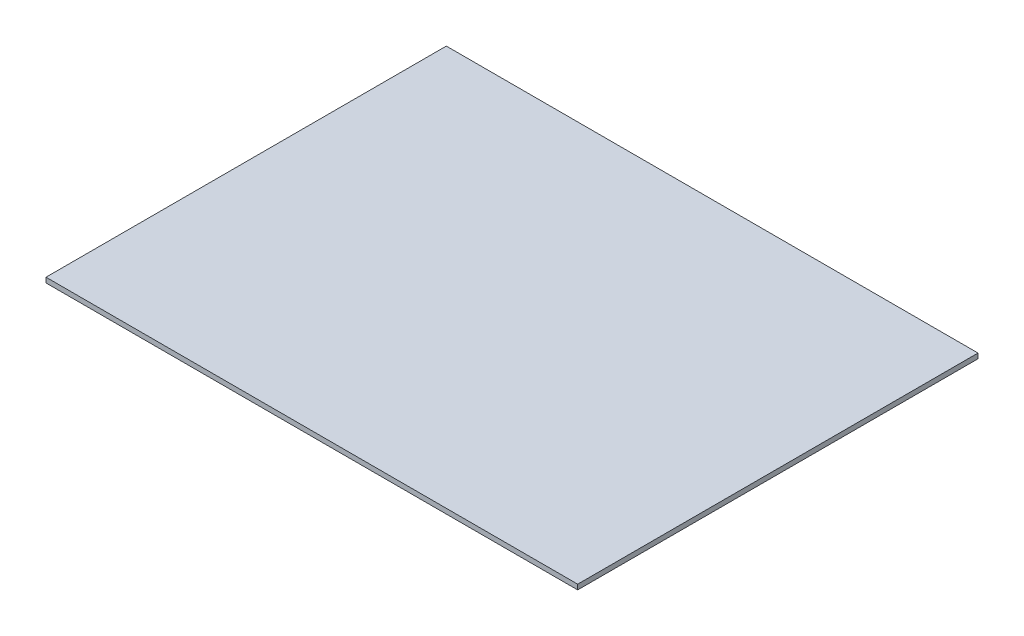
ISO-10303-21;
HEADER;
FILE_DESCRIPTION(('STEP AP214'),'2;1');
FILE_NAME('part.step','',(''),(''),'','','');
FILE_SCHEMA(('AUTOMOTIVE_DESIGN { 1 0 10303 214 1 1 1 1 }'));
ENDSEC;
DATA;
#1=APPLICATION_CONTEXT('core data for automotive mechanical design processes');
#2=APPLICATION_PROTOCOL_DEFINITION('international standard','automotive_design',2000,#1);
#3=PRODUCT_CONTEXT('',#1,'mechanical');
#4=PRODUCT('Part','Part','',(#3));
#5=PRODUCT_RELATED_PRODUCT_CATEGORY('part','',(#4));
#6=PRODUCT_DEFINITION_FORMATION('','',#4);
#7=PRODUCT_DEFINITION_CONTEXT('part definition',#1,'design');
#8=PRODUCT_DEFINITION('design','',#6,#7);
#9=PRODUCT_DEFINITION_SHAPE('','',#8);
#10=(LENGTH_UNIT() NAMED_UNIT(*) SI_UNIT(.MILLI.,.METRE.));
#11=(NAMED_UNIT(*) PLANE_ANGLE_UNIT() SI_UNIT($,.RADIAN.));
#12=(NAMED_UNIT(*) SI_UNIT($,.STERADIAN.) SOLID_ANGLE_UNIT());
#13=UNCERTAINTY_MEASURE_WITH_UNIT(LENGTH_MEASURE(1.E-05),#10,'distance_accuracy_value','');
#14=(GEOMETRIC_REPRESENTATION_CONTEXT(3) GLOBAL_UNCERTAINTY_ASSIGNED_CONTEXT((#13)) GLOBAL_UNIT_ASSIGNED_CONTEXT((#10,
#11,#12)) REPRESENTATION_CONTEXT('',''));
#15=CARTESIAN_POINT('',(0.,0.,0.));
#16=DIRECTION('',(0.,0.,1.));
#17=DIRECTION('',(1.,0.,0.));
#18=AXIS2_PLACEMENT_3D('',#15,#16,#17);
#19=CARTESIAN_POINT('',(212.5,4.,160.));
#20=DIRECTION('',(-1.,0.,0.));
#21=DIRECTION('',(0.,0.,1.));
#22=AXIS2_PLACEMENT_3D('',#19,#20,#21);
#23=PLANE('',#22);
#24=DIRECTION('',(0.,0.,-1.));
#25=VECTOR('',#24,1.);
#26=CARTESIAN_POINT('',(212.5,0.,160.));
#27=LINE('',#26,#25);
#28=CARTESIAN_POINT('',(212.5,0.,160.));
#29=VERTEX_POINT('',#28);
#30=CARTESIAN_POINT('',(212.5,0.,-160.));
#31=VERTEX_POINT('',#30);
#32=EDGE_CURVE('E99',#29,#31,#27,.T.);
#33=ORIENTED_EDGE('',*,*,#32,.T.);
#34=DIRECTION('',(0.,-1.,0.));
#35=VECTOR('',#34,1.);
#36=CARTESIAN_POINT('',(212.5,4.,-160.));
#37=LINE('',#36,#35);
#38=CARTESIAN_POINT('',(212.5,4.,-160.));
#39=VERTEX_POINT('',#38);
#40=EDGE_CURVE('E11',#39,#31,#37,.T.);
#41=ORIENTED_EDGE('',*,*,#40,.F.);
#42=DIRECTION('',(0.,0.,-1.));
#43=VECTOR('',#42,1.);
#44=CARTESIAN_POINT('',(212.5,4.,160.));
#45=LINE('',#44,#43);
#46=CARTESIAN_POINT('',(212.5,4.,160.));
#47=VERTEX_POINT('',#46);
#48=EDGE_CURVE('E87',#47,#39,#45,.T.);
#49=ORIENTED_EDGE('',*,*,#48,.F.);
#50=DIRECTION('',(0.,-1.,0.));
#51=VECTOR('',#50,1.);
#52=CARTESIAN_POINT('',(212.5,4.,160.));
#53=LINE('',#52,#51);
#54=EDGE_CURVE('E95',#47,#29,#53,.T.);
#55=ORIENTED_EDGE('',*,*,#54,.T.);
#56=EDGE_LOOP('',(#33,#41,#49,#55));
#57=FACE_BOUND('',#56,.T.);
#58=ADVANCED_FACE('F36',(#57),#23,.F.);
#59=CARTESIAN_POINT('',(-212.5,4.,-160.));
#60=DIRECTION('',(0.,0.,1.));
#61=DIRECTION('',(1.,0.,0.));
#62=AXIS2_PLACEMENT_3D('',#59,#60,#61);
#63=PLANE('',#62);
#64=DIRECTION('',(-1.,0.,0.));
#65=VECTOR('',#64,1.);
#66=CARTESIAN_POINT('',(-212.5,0.,-160.));
#67=LINE('',#66,#65);
#68=CARTESIAN_POINT('',(-212.5,0.,-160.));
#69=VERTEX_POINT('',#68);
#70=EDGE_CURVE('E91',#31,#69,#67,.T.);
#71=ORIENTED_EDGE('',*,*,#70,.T.);
#72=DIRECTION('',(0.,-1.,0.));
#73=VECTOR('',#72,1.);
#74=CARTESIAN_POINT('',(-212.5,4.,-160.));
#75=LINE('',#74,#73);
#76=CARTESIAN_POINT('',(-212.5,4.,-160.));
#77=VERTEX_POINT('',#76);
#78=EDGE_CURVE('E44',#77,#69,#75,.T.);
#79=ORIENTED_EDGE('',*,*,#78,.F.);
#80=DIRECTION('',(-1.,0.,0.));
#81=VECTOR('',#80,1.);
#82=CARTESIAN_POINT('',(-212.5,4.,-160.));
#83=LINE('',#82,#81);
#84=EDGE_CURVE('E82',#39,#77,#83,.T.);
#85=ORIENTED_EDGE('',*,*,#84,.F.);
#86=ORIENTED_EDGE('',*,*,#40,.T.);
#87=EDGE_LOOP('',(#71,#79,#85,#86));
#88=FACE_BOUND('',#87,.T.);
#89=ADVANCED_FACE('F90',(#88),#63,.F.);
#90=CARTESIAN_POINT('',(-212.5,4.,160.));
#91=DIRECTION('',(1.,0.,0.));
#92=DIRECTION('',(0.,0.,-1.));
#93=AXIS2_PLACEMENT_3D('',#90,#91,#92);
#94=PLANE('',#93);
#95=DIRECTION('',(0.,0.,1.));
#96=VECTOR('',#95,1.);
#97=CARTESIAN_POINT('',(-212.5,0.,160.));
#98=LINE('',#97,#96);
#99=CARTESIAN_POINT('',(-212.5,0.,160.));
#100=VERTEX_POINT('',#99);
#101=EDGE_CURVE('E69',#69,#100,#98,.T.);
#102=ORIENTED_EDGE('',*,*,#101,.T.);
#103=DIRECTION('',(0.,-1.,0.));
#104=VECTOR('',#103,1.);
#105=CARTESIAN_POINT('',(-212.5,4.,160.));
#106=LINE('',#105,#104);
#107=CARTESIAN_POINT('',(-212.5,4.,160.));
#108=VERTEX_POINT('',#107);
#109=EDGE_CURVE('E92',#108,#100,#106,.T.);
#110=ORIENTED_EDGE('',*,*,#109,.F.);
#111=DIRECTION('',(0.,0.,1.));
#112=VECTOR('',#111,1.);
#113=CARTESIAN_POINT('',(-212.5,4.,160.));
#114=LINE('',#113,#112);
#115=EDGE_CURVE('E85',#77,#108,#114,.T.);
#116=ORIENTED_EDGE('',*,*,#115,.F.);
#117=ORIENTED_EDGE('',*,*,#78,.T.);
#118=EDGE_LOOP('',(#102,#110,#116,#117));
#119=FACE_BOUND('',#118,.T.);
#120=ADVANCED_FACE('F93',(#119),#94,.F.);
#121=CARTESIAN_POINT('',(-212.5,4.,160.));
#122=DIRECTION('',(0.,0.,-1.));
#123=DIRECTION('',(-1.,0.,0.));
#124=AXIS2_PLACEMENT_3D('',#121,#122,#123);
#125=PLANE('',#124);
#126=DIRECTION('',(1.,0.,0.));
#127=VECTOR('',#126,1.);
#128=CARTESIAN_POINT('',(-212.5,0.,160.));
#129=LINE('',#128,#127);
#130=EDGE_CURVE('E75',#100,#29,#129,.T.);
#131=ORIENTED_EDGE('',*,*,#130,.T.);
#132=ORIENTED_EDGE('',*,*,#54,.F.);
#133=DIRECTION('',(1.,0.,0.));
#134=VECTOR('',#133,1.);
#135=CARTESIAN_POINT('',(-212.5,4.,160.));
#136=LINE('',#135,#134);
#137=EDGE_CURVE('E52',#108,#47,#136,.T.);
#138=ORIENTED_EDGE('',*,*,#137,.F.);
#139=ORIENTED_EDGE('',*,*,#109,.T.);
#140=EDGE_LOOP('',(#131,#132,#138,#139));
#141=FACE_BOUND('',#140,.T.);
#142=ADVANCED_FACE('F106',(#141),#125,.F.);
#143=CARTESIAN_POINT('',(0.,4.,0.));
#144=DIRECTION('',(0.,-1.,0.));
#145=DIRECTION('',(0.,0.,-1.));
#146=AXIS2_PLACEMENT_3D('',#143,#144,#145);
#147=PLANE('',#146);
#148=ORIENTED_EDGE('',*,*,#48,.T.);
#149=ORIENTED_EDGE('',*,*,#84,.T.);
#150=ORIENTED_EDGE('',*,*,#115,.T.);
#151=ORIENTED_EDGE('',*,*,#137,.T.);
#152=EDGE_LOOP('',(#148,#149,#150,#151));
#153=FACE_BOUND('',#152,.T.);
#154=ADVANCED_FACE('F83',(#153),#147,.F.);
#155=CARTESIAN_POINT('',(0.,0.,0.));
#156=DIRECTION('',(0.,-1.,0.));
#157=DIRECTION('',(0.,0.,-1.));
#158=AXIS2_PLACEMENT_3D('',#155,#156,#157);
#159=PLANE('',#158);
#160=ORIENTED_EDGE('',*,*,#32,.F.);
#161=ORIENTED_EDGE('',*,*,#130,.F.);
#162=ORIENTED_EDGE('',*,*,#101,.F.);
#163=ORIENTED_EDGE('',*,*,#70,.F.);
#164=EDGE_LOOP('',(#160,#161,#162,#163));
#165=FACE_BOUND('',#164,.T.);
#166=ADVANCED_FACE('F109',(#165),#159,.T.);
#167=CLOSED_SHELL('',(#58,#89,#120,#142,#154,#166));
#168=MANIFOLD_SOLID_BREP('B2',#167);
#169=ADVANCED_BREP_SHAPE_REPRESENTATION('',(#18,#168),#14);
#170=SHAPE_DEFINITION_REPRESENTATION(#9,#169);
ENDSEC;
END-ISO-10303-21;
